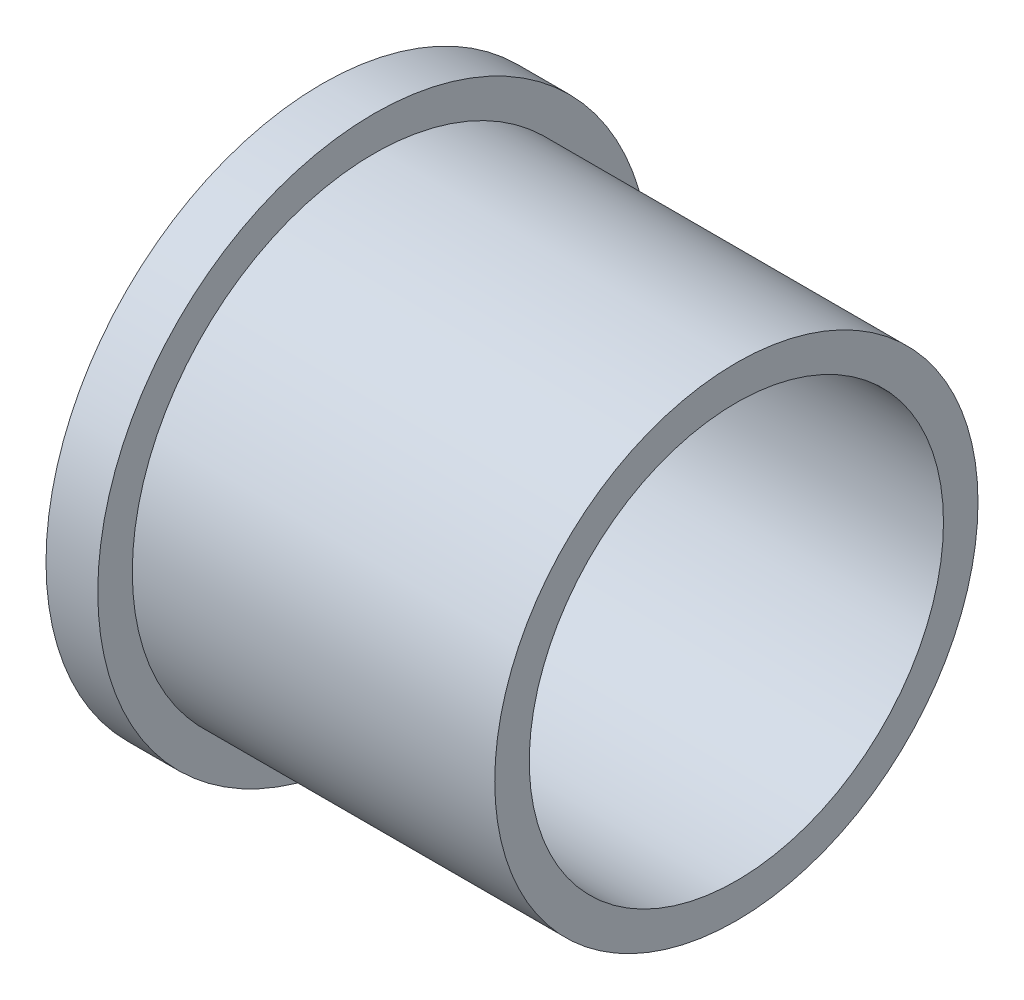
ISO-10303-21;
HEADER;
FILE_DESCRIPTION(('STEP AP214'),'2;1');
FILE_NAME('part.step','',(''),(''),'','','');
FILE_SCHEMA(('AUTOMOTIVE_DESIGN { 1 0 10303 214 1 1 1 1 }'));
ENDSEC;
DATA;
#1=APPLICATION_CONTEXT('core data for automotive mechanical design processes');
#2=APPLICATION_PROTOCOL_DEFINITION('international standard','automotive_design',2000,#1);
#3=PRODUCT_CONTEXT('',#1,'mechanical');
#4=PRODUCT('Part','Part','',(#3));
#5=PRODUCT_RELATED_PRODUCT_CATEGORY('part','',(#4));
#6=PRODUCT_DEFINITION_FORMATION('','',#4);
#7=PRODUCT_DEFINITION_CONTEXT('part definition',#1,'design');
#8=PRODUCT_DEFINITION('design','',#6,#7);
#9=PRODUCT_DEFINITION_SHAPE('','',#8);
#10=(LENGTH_UNIT() NAMED_UNIT(*) SI_UNIT(.MILLI.,.METRE.));
#11=(NAMED_UNIT(*) PLANE_ANGLE_UNIT() SI_UNIT($,.RADIAN.));
#12=(NAMED_UNIT(*) SI_UNIT($,.STERADIAN.) SOLID_ANGLE_UNIT());
#13=UNCERTAINTY_MEASURE_WITH_UNIT(LENGTH_MEASURE(1.E-05),#10,'distance_accuracy_value','');
#14=(GEOMETRIC_REPRESENTATION_CONTEXT(3) GLOBAL_UNCERTAINTY_ASSIGNED_CONTEXT((#13)) GLOBAL_UNIT_ASSIGNED_CONTEXT((#10,
#11,#12)) REPRESENTATION_CONTEXT('',''));
#15=CARTESIAN_POINT('',(0.,0.,0.));
#16=DIRECTION('',(0.,0.,1.));
#17=DIRECTION('',(1.,0.,0.));
#18=AXIS2_PLACEMENT_3D('',#15,#16,#17);
#19=CARTESIAN_POINT('',(38.1,0.,0.));
#20=DIRECTION('',(-1.,0.,0.));
#21=DIRECTION('',(0.,0.,1.));
#22=AXIS2_PLACEMENT_3D('',#19,#20,#21);
#23=CYLINDRICAL_SURFACE('',#22,22.225);
#24=CARTESIAN_POINT('',(38.1,0.,0.));
#25=DIRECTION('',(1.,0.,0.));
#26=DIRECTION('',(0.,0.,-1.));
#27=AXIS2_PLACEMENT_3D('',#24,#25,#26);
#28=CIRCLE('',#27,22.225);
#29=CARTESIAN_POINT('',(38.1,0.,-22.225));
#30=VERTEX_POINT('',#29);
#31=EDGE_CURVE('E36',#30,#30,#28,.T.);
#32=ORIENTED_EDGE('',*,*,#31,.F.);
#33=EDGE_LOOP('',(#32));
#34=FACE_BOUND('',#33,.T.);
#35=CARTESIAN_POINT('',(4.7625,0.,0.));
#36=DIRECTION('',(-1.,0.,0.));
#37=DIRECTION('',(0.,0.,1.));
#38=AXIS2_PLACEMENT_3D('',#35,#36,#37);
#39=CIRCLE('',#38,22.225);
#40=CARTESIAN_POINT('',(4.7625,0.,22.225));
#41=VERTEX_POINT('',#40);
#42=EDGE_CURVE('E10',#41,#41,#39,.T.);
#43=ORIENTED_EDGE('',*,*,#42,.F.);
#44=EDGE_LOOP('',(#43));
#45=FACE_BOUND('',#44,.T.);
#46=ADVANCED_FACE('F30',(#34,#45),#23,.T.);
#47=CARTESIAN_POINT('',(38.1,0.,0.));
#48=DIRECTION('',(1.,0.,0.));
#49=DIRECTION('',(0.,0.,-1.));
#50=AXIS2_PLACEMENT_3D('',#47,#48,#49);
#51=PLANE('',#50);
#52=ORIENTED_EDGE('',*,*,#31,.T.);
#53=EDGE_LOOP('',(#52));
#54=FACE_BOUND('',#53,.T.);
#55=CARTESIAN_POINT('',(38.1,0.,0.));
#56=DIRECTION('',(1.,0.,0.));
#57=DIRECTION('',(0.,0.,-1.));
#58=AXIS2_PLACEMENT_3D('',#55,#56,#57);
#59=CIRCLE('',#58,19.05);
#60=CARTESIAN_POINT('',(38.1,0.,-19.05));
#61=VERTEX_POINT('',#60);
#62=EDGE_CURVE('E40',#61,#61,#59,.T.);
#63=ORIENTED_EDGE('',*,*,#62,.F.);
#64=EDGE_LOOP('',(#63));
#65=FACE_BOUND('',#64,.T.);
#66=ADVANCED_FACE('F68',(#54,#65),#51,.T.);
#67=CARTESIAN_POINT('',(0.,0.,0.));
#68=DIRECTION('',(1.,0.,0.));
#69=DIRECTION('',(0.,0.,-1.));
#70=AXIS2_PLACEMENT_3D('',#67,#68,#69);
#71=PLANE('',#70);
#72=CARTESIAN_POINT('',(0.,0.,0.));
#73=DIRECTION('',(1.,0.,0.));
#74=DIRECTION('',(0.,0.,-1.));
#75=AXIS2_PLACEMENT_3D('',#72,#73,#74);
#76=CIRCLE('',#75,19.05);
#77=CARTESIAN_POINT('',(0.,0.,-19.05));
#78=VERTEX_POINT('',#77);
#79=EDGE_CURVE('E44',#78,#78,#76,.T.);
#80=ORIENTED_EDGE('',*,*,#79,.T.);
#81=EDGE_LOOP('',(#80));
#82=FACE_BOUND('',#81,.T.);
#83=CARTESIAN_POINT('',(0.,0.,0.));
#84=DIRECTION('',(-1.,0.,0.));
#85=DIRECTION('',(0.,0.,1.));
#86=AXIS2_PLACEMENT_3D('',#83,#84,#85);
#87=CIRCLE('',#86,25.4);
#88=CARTESIAN_POINT('',(0.,0.,25.4));
#89=VERTEX_POINT('',#88);
#90=EDGE_CURVE('E50',#89,#89,#87,.T.);
#91=ORIENTED_EDGE('',*,*,#90,.T.);
#92=EDGE_LOOP('',(#91));
#93=FACE_BOUND('',#92,.T.);
#94=ADVANCED_FACE('F73',(#82,#93),#71,.F.);
#95=CARTESIAN_POINT('',(38.1,0.,0.));
#96=DIRECTION('',(-1.,0.,0.));
#97=DIRECTION('',(0.,0.,1.));
#98=AXIS2_PLACEMENT_3D('',#95,#96,#97);
#99=CYLINDRICAL_SURFACE('',#98,19.05);
#100=ORIENTED_EDGE('',*,*,#62,.T.);
#101=EDGE_LOOP('',(#100));
#102=FACE_BOUND('',#101,.T.);
#103=ORIENTED_EDGE('',*,*,#79,.F.);
#104=EDGE_LOOP('',(#103));
#105=FACE_BOUND('',#104,.T.);
#106=ADVANCED_FACE('F65',(#102,#105),#99,.F.);
#107=CARTESIAN_POINT('',(4.7625,0.,0.));
#108=DIRECTION('',(-1.,0.,0.));
#109=DIRECTION('',(0.,0.,1.));
#110=AXIS2_PLACEMENT_3D('',#107,#108,#109);
#111=CYLINDRICAL_SURFACE('',#110,25.4);
#112=CARTESIAN_POINT('',(4.7625,0.,0.));
#113=DIRECTION('',(-1.,0.,0.));
#114=DIRECTION('',(0.,0.,1.));
#115=AXIS2_PLACEMENT_3D('',#112,#113,#114);
#116=CIRCLE('',#115,25.4);
#117=CARTESIAN_POINT('',(4.7625,0.,25.4));
#118=VERTEX_POINT('',#117);
#119=EDGE_CURVE('E48',#118,#118,#116,.T.);
#120=ORIENTED_EDGE('',*,*,#119,.T.);
#121=EDGE_LOOP('',(#120));
#122=FACE_BOUND('',#121,.T.);
#123=ORIENTED_EDGE('',*,*,#90,.F.);
#124=EDGE_LOOP('',(#123));
#125=FACE_BOUND('',#124,.T.);
#126=ADVANCED_FACE('F56',(#122,#125),#111,.T.);
#127=CARTESIAN_POINT('',(4.7625,0.,0.));
#128=DIRECTION('',(-1.,0.,0.));
#129=DIRECTION('',(0.,0.,1.));
#130=AXIS2_PLACEMENT_3D('',#127,#128,#129);
#131=PLANE('',#130);
#132=ORIENTED_EDGE('',*,*,#42,.T.);
#133=EDGE_LOOP('',(#132));
#134=FACE_BOUND('',#133,.T.);
#135=ORIENTED_EDGE('',*,*,#119,.F.);
#136=EDGE_LOOP('',(#135));
#137=FACE_BOUND('',#136,.T.);
#138=ADVANCED_FACE('F59',(#134,#137),#131,.F.);
#139=CLOSED_SHELL('',(#46,#66,#94,#106,#126,#138));
#140=MANIFOLD_SOLID_BREP('B2',#139);
#141=ADVANCED_BREP_SHAPE_REPRESENTATION('',(#18,#140),#14);
#142=SHAPE_DEFINITION_REPRESENTATION(#9,#141);
ENDSEC;
END-ISO-10303-21;
